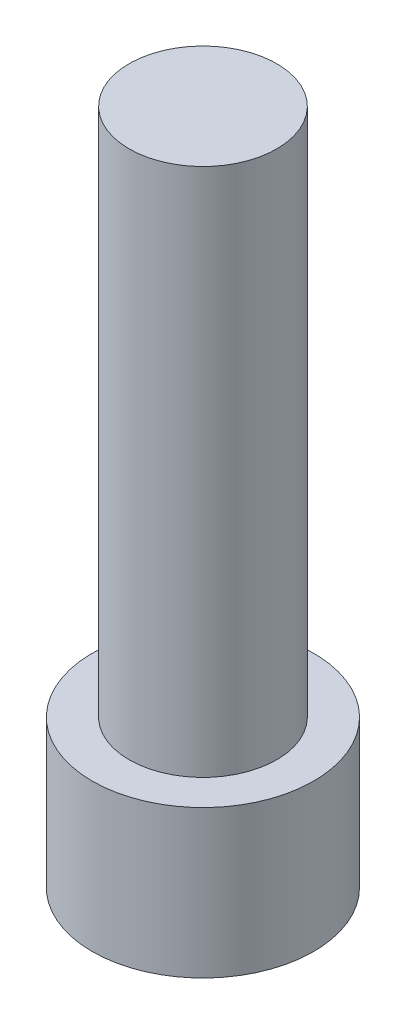
ISO-10303-21;
HEADER;
FILE_DESCRIPTION(('STEP AP214'),'2;1');
FILE_NAME('part.step','',(''),(''),'','','');
FILE_SCHEMA(('AUTOMOTIVE_DESIGN { 1 0 10303 214 1 1 1 1 }'));
ENDSEC;
DATA;
#1=APPLICATION_CONTEXT('core data for automotive mechanical design processes');
#2=APPLICATION_PROTOCOL_DEFINITION('international standard','automotive_design',2000,#1);
#3=PRODUCT_CONTEXT('',#1,'mechanical');
#4=PRODUCT('Part','Part','',(#3));
#5=PRODUCT_RELATED_PRODUCT_CATEGORY('part','',(#4));
#6=PRODUCT_DEFINITION_FORMATION('','',#4);
#7=PRODUCT_DEFINITION_CONTEXT('part definition',#1,'design');
#8=PRODUCT_DEFINITION('design','',#6,#7);
#9=PRODUCT_DEFINITION_SHAPE('','',#8);
#10=(LENGTH_UNIT() NAMED_UNIT(*) SI_UNIT(.MILLI.,.METRE.));
#11=(NAMED_UNIT(*) PLANE_ANGLE_UNIT() SI_UNIT($,.RADIAN.));
#12=(NAMED_UNIT(*) SI_UNIT($,.STERADIAN.) SOLID_ANGLE_UNIT());
#13=UNCERTAINTY_MEASURE_WITH_UNIT(LENGTH_MEASURE(1.E-05),#10,'distance_accuracy_value','');
#14=(GEOMETRIC_REPRESENTATION_CONTEXT(3) GLOBAL_UNCERTAINTY_ASSIGNED_CONTEXT((#13)) GLOBAL_UNIT_ASSIGNED_CONTEXT((#10,
#11,#12)) REPRESENTATION_CONTEXT('',''));
#15=CARTESIAN_POINT('',(0.,0.,0.));
#16=DIRECTION('',(0.,0.,1.));
#17=DIRECTION('',(1.,0.,0.));
#18=AXIS2_PLACEMENT_3D('',#15,#16,#17);
#19=CARTESIAN_POINT('',(0.,6.,0.));
#20=DIRECTION('',(0.,-1.,0.));
#21=DIRECTION('',(0.,0.,-1.));
#22=AXIS2_PLACEMENT_3D('',#19,#20,#21);
#23=CYLINDRICAL_SURFACE('',#22,4.5);
#24=CARTESIAN_POINT('',(0.,6.,0.));
#25=DIRECTION('',(0.,1.,0.));
#26=DIRECTION('',(0.,0.,1.));
#27=AXIS2_PLACEMENT_3D('',#24,#25,#26);
#28=CIRCLE('',#27,4.5);
#29=CARTESIAN_POINT('',(0.,6.,4.5));
#30=VERTEX_POINT('',#29);
#31=EDGE_CURVE('E45',#30,#30,#28,.T.);
#32=ORIENTED_EDGE('',*,*,#31,.F.);
#33=EDGE_LOOP('',(#32));
#34=FACE_BOUND('',#33,.T.);
#35=CARTESIAN_POINT('',(0.,0.,0.));
#36=DIRECTION('',(0.,1.,0.));
#37=DIRECTION('',(0.,0.,1.));
#38=AXIS2_PLACEMENT_3D('',#35,#36,#37);
#39=CIRCLE('',#38,4.5);
#40=CARTESIAN_POINT('',(0.,0.,4.5));
#41=VERTEX_POINT('',#40);
#42=EDGE_CURVE('E40',#41,#41,#39,.T.);
#43=ORIENTED_EDGE('',*,*,#42,.T.);
#44=EDGE_LOOP('',(#43));
#45=FACE_BOUND('',#44,.T.);
#46=ADVANCED_FACE('F37',(#34,#45),#23,.T.);
#47=CARTESIAN_POINT('',(0.,6.,0.));
#48=DIRECTION('',(0.,1.,0.));
#49=DIRECTION('',(0.,0.,1.));
#50=AXIS2_PLACEMENT_3D('',#47,#48,#49);
#51=PLANE('',#50);
#52=CARTESIAN_POINT('',(0.,6.,0.));
#53=DIRECTION('',(0.,1.,0.));
#54=DIRECTION('',(0.,0.,1.));
#55=AXIS2_PLACEMENT_3D('',#52,#53,#54);
#56=CIRCLE('',#55,3.);
#57=CARTESIAN_POINT('',(0.,6.,3.));
#58=VERTEX_POINT('',#57);
#59=EDGE_CURVE('E11',#58,#58,#56,.T.);
#60=ORIENTED_EDGE('',*,*,#59,.F.);
#61=EDGE_LOOP('',(#60));
#62=FACE_BOUND('',#61,.T.);
#63=ORIENTED_EDGE('',*,*,#31,.T.);
#64=EDGE_LOOP('',(#63));
#65=FACE_BOUND('',#64,.T.);
#66=ADVANCED_FACE('F157',(#62,#65),#51,.T.);
#67=CARTESIAN_POINT('',(0.,0.,0.));
#68=DIRECTION('',(0.,1.,0.));
#69=DIRECTION('',(0.,0.,1.));
#70=AXIS2_PLACEMENT_3D('',#67,#68,#69);
#71=PLANE('',#70);
#72=DIRECTION('',(-0.5,0.,0.866025403784438));
#73=VECTOR('',#72,1.);
#74=CARTESIAN_POINT('',(2.88675134594813,0.,0.));
#75=LINE('',#74,#73);
#76=CARTESIAN_POINT('',(2.88675134594813,0.,0.));
#77=VERTEX_POINT('',#76);
#78=CARTESIAN_POINT('',(1.44337567297406,0.,2.5));
#79=VERTEX_POINT('',#78);
#80=EDGE_CURVE('E127',#77,#79,#75,.T.);
#81=ORIENTED_EDGE('',*,*,#80,.F.);
#82=DIRECTION('',(0.5,0.,0.866025403784439));
#83=VECTOR('',#82,1.);
#84=CARTESIAN_POINT('',(1.44337567297407,0.,-2.5));
#85=LINE('',#84,#83);
#86=CARTESIAN_POINT('',(1.44337567297407,0.,-2.5));
#87=VERTEX_POINT('',#86);
#88=EDGE_CURVE('E53',#87,#77,#85,.T.);
#89=ORIENTED_EDGE('',*,*,#88,.F.);
#90=DIRECTION('',(1.,0.,0.));
#91=VECTOR('',#90,1.);
#92=CARTESIAN_POINT('',(-1.44337567297406,0.,-2.5));
#93=LINE('',#92,#91);
#94=CARTESIAN_POINT('',(-1.44337567297406,0.,-2.5));
#95=VERTEX_POINT('',#94);
#96=EDGE_CURVE('E136',#95,#87,#93,.T.);
#97=ORIENTED_EDGE('',*,*,#96,.F.);
#98=DIRECTION('',(0.5,0.,-0.866025403784438));
#99=VECTOR('',#98,1.);
#100=CARTESIAN_POINT('',(-2.88675134594813,0.,0.));
#101=LINE('',#100,#99);
#102=CARTESIAN_POINT('',(-2.88675134594813,0.,0.));
#103=VERTEX_POINT('',#102);
#104=EDGE_CURVE('E134',#103,#95,#101,.T.);
#105=ORIENTED_EDGE('',*,*,#104,.F.);
#106=DIRECTION('',(-0.5,0.,-0.866025403784439));
#107=VECTOR('',#106,1.);
#108=CARTESIAN_POINT('',(-1.44337567297406,0.,2.5));
#109=LINE('',#108,#107);
#110=CARTESIAN_POINT('',(-1.44337567297406,0.,2.5));
#111=VERTEX_POINT('',#110);
#112=EDGE_CURVE('E101',#111,#103,#109,.T.);
#113=ORIENTED_EDGE('',*,*,#112,.F.);
#114=DIRECTION('',(-1.,0.,0.));
#115=VECTOR('',#114,1.);
#116=CARTESIAN_POINT('',(1.44337567297406,0.,2.5));
#117=LINE('',#116,#115);
#118=EDGE_CURVE('E130',#79,#111,#117,.T.);
#119=ORIENTED_EDGE('',*,*,#118,.F.);
#120=EDGE_LOOP('',(#81,#89,#97,#105,#113,#119));
#121=FACE_BOUND('',#120,.T.);
#122=ORIENTED_EDGE('',*,*,#42,.F.);
#123=EDGE_LOOP('',(#122));
#124=FACE_BOUND('',#123,.T.);
#125=ADVANCED_FACE('F154',(#121,#124),#71,.F.);
#126=CARTESIAN_POINT('',(0.,27.5,0.));
#127=DIRECTION('',(0.,-1.,0.));
#128=DIRECTION('',(0.,0.,-1.));
#129=AXIS2_PLACEMENT_3D('',#126,#127,#128);
#130=CYLINDRICAL_SURFACE('',#129,3.);
#131=CARTESIAN_POINT('',(0.,27.5,0.));
#132=DIRECTION('',(0.,1.,0.));
#133=DIRECTION('',(0.,0.,1.));
#134=AXIS2_PLACEMENT_3D('',#131,#132,#133);
#135=CIRCLE('',#134,3.);
#136=CARTESIAN_POINT('',(0.,27.5,3.));
#137=VERTEX_POINT('',#136);
#138=EDGE_CURVE('E140',#137,#137,#135,.T.);
#139=ORIENTED_EDGE('',*,*,#138,.F.);
#140=EDGE_LOOP('',(#139));
#141=FACE_BOUND('',#140,.T.);
#142=ORIENTED_EDGE('',*,*,#59,.T.);
#143=EDGE_LOOP('',(#142));
#144=FACE_BOUND('',#143,.T.);
#145=ADVANCED_FACE('F156',(#141,#144),#130,.T.);
#146=CARTESIAN_POINT('',(0.,27.5,0.));
#147=DIRECTION('',(0.,1.,0.));
#148=DIRECTION('',(0.,0.,1.));
#149=AXIS2_PLACEMENT_3D('',#146,#147,#148);
#150=PLANE('',#149);
#151=ORIENTED_EDGE('',*,*,#138,.T.);
#152=EDGE_LOOP('',(#151));
#153=FACE_BOUND('',#152,.T.);
#154=ADVANCED_FACE('F163',(#153),#150,.T.);
#155=CARTESIAN_POINT('',(1.44337567297407,5.,-2.5));
#156=DIRECTION('',(0.866025403784439,0.,-0.5));
#157=DIRECTION('',(-0.5,0.,-0.866025403784439));
#158=AXIS2_PLACEMENT_3D('',#155,#156,#157);
#159=PLANE('',#158);
#160=ORIENTED_EDGE('',*,*,#88,.T.);
#161=DIRECTION('',(0.,-1.,0.));
#162=VECTOR('',#161,1.);
#163=CARTESIAN_POINT('',(2.88675134594813,5.,0.));
#164=LINE('',#163,#162);
#165=CARTESIAN_POINT('',(2.88675134594813,5.,0.));
#166=VERTEX_POINT('',#165);
#167=EDGE_CURVE('E83',#166,#77,#164,.T.);
#168=ORIENTED_EDGE('',*,*,#167,.F.);
#169=DIRECTION('',(0.5,0.,0.866025403784439));
#170=VECTOR('',#169,1.);
#171=CARTESIAN_POINT('',(1.44337567297407,5.,-2.5));
#172=LINE('',#171,#170);
#173=CARTESIAN_POINT('',(1.44337567297407,5.,-2.5));
#174=VERTEX_POINT('',#173);
#175=EDGE_CURVE('E138',#174,#166,#172,.T.);
#176=ORIENTED_EDGE('',*,*,#175,.F.);
#177=DIRECTION('',(0.,-1.,0.));
#178=VECTOR('',#177,1.);
#179=CARTESIAN_POINT('',(1.44337567297407,5.,-2.5));
#180=LINE('',#179,#178);
#181=EDGE_CURVE('E61',#174,#87,#180,.T.);
#182=ORIENTED_EDGE('',*,*,#181,.T.);
#183=EDGE_LOOP('',(#160,#168,#176,#182));
#184=FACE_BOUND('',#183,.T.);
#185=ADVANCED_FACE('F192',(#184),#159,.F.);
#186=CARTESIAN_POINT('',(-1.44337567297406,5.,-2.5));
#187=DIRECTION('',(0.,0.,-1.));
#188=DIRECTION('',(-1.,0.,0.));
#189=AXIS2_PLACEMENT_3D('',#186,#187,#188);
#190=PLANE('',#189);
#191=ORIENTED_EDGE('',*,*,#96,.T.);
#192=ORIENTED_EDGE('',*,*,#181,.F.);
#193=DIRECTION('',(1.,0.,0.));
#194=VECTOR('',#193,1.);
#195=CARTESIAN_POINT('',(-1.44337567297406,5.,-2.5));
#196=LINE('',#195,#194);
#197=CARTESIAN_POINT('',(-1.44337567297406,5.,-2.5));
#198=VERTEX_POINT('',#197);
#199=EDGE_CURVE('E113',#198,#174,#196,.T.);
#200=ORIENTED_EDGE('',*,*,#199,.F.);
#201=DIRECTION('',(0.,-1.,0.));
#202=VECTOR('',#201,1.);
#203=CARTESIAN_POINT('',(-1.44337567297406,5.,-2.5));
#204=LINE('',#203,#202);
#205=EDGE_CURVE('E105',#198,#95,#204,.T.);
#206=ORIENTED_EDGE('',*,*,#205,.T.);
#207=EDGE_LOOP('',(#191,#192,#200,#206));
#208=FACE_BOUND('',#207,.T.);
#209=ADVANCED_FACE('F206',(#208),#190,.F.);
#210=CARTESIAN_POINT('',(-2.88675134594813,5.,0.));
#211=DIRECTION('',(-0.866025403784438,0.,-0.5));
#212=DIRECTION('',(-0.5,0.,0.866025403784438));
#213=AXIS2_PLACEMENT_3D('',#210,#211,#212);
#214=PLANE('',#213);
#215=ORIENTED_EDGE('',*,*,#104,.T.);
#216=ORIENTED_EDGE('',*,*,#205,.F.);
#217=DIRECTION('',(0.5,0.,-0.866025403784438));
#218=VECTOR('',#217,1.);
#219=CARTESIAN_POINT('',(-2.88675134594813,5.,0.));
#220=LINE('',#219,#218);
#221=CARTESIAN_POINT('',(-2.88675134594813,5.,0.));
#222=VERTEX_POINT('',#221);
#223=EDGE_CURVE('E109',#222,#198,#220,.T.);
#224=ORIENTED_EDGE('',*,*,#223,.F.);
#225=DIRECTION('',(0.,-1.,0.));
#226=VECTOR('',#225,1.);
#227=CARTESIAN_POINT('',(-2.88675134594813,5.,0.));
#228=LINE('',#227,#226);
#229=EDGE_CURVE('E94',#222,#103,#228,.T.);
#230=ORIENTED_EDGE('',*,*,#229,.T.);
#231=EDGE_LOOP('',(#215,#216,#224,#230));
#232=FACE_BOUND('',#231,.T.);
#233=ADVANCED_FACE('F110',(#232),#214,.F.);
#234=CARTESIAN_POINT('',(-1.44337567297406,5.,2.5));
#235=DIRECTION('',(-0.866025403784439,0.,0.5));
#236=DIRECTION('',(0.5,0.,0.866025403784439));
#237=AXIS2_PLACEMENT_3D('',#234,#235,#236);
#238=PLANE('',#237);
#239=ORIENTED_EDGE('',*,*,#112,.T.);
#240=ORIENTED_EDGE('',*,*,#229,.F.);
#241=DIRECTION('',(-0.5,0.,-0.866025403784439));
#242=VECTOR('',#241,1.);
#243=CARTESIAN_POINT('',(-1.44337567297406,5.,2.5));
#244=LINE('',#243,#242);
#245=CARTESIAN_POINT('',(-1.44337567297406,5.,2.5));
#246=VERTEX_POINT('',#245);
#247=EDGE_CURVE('E98',#246,#222,#244,.T.);
#248=ORIENTED_EDGE('',*,*,#247,.F.);
#249=DIRECTION('',(0.,-1.,0.));
#250=VECTOR('',#249,1.);
#251=CARTESIAN_POINT('',(-1.44337567297406,5.,2.5));
#252=LINE('',#251,#250);
#253=EDGE_CURVE('E106',#246,#111,#252,.T.);
#254=ORIENTED_EDGE('',*,*,#253,.T.);
#255=EDGE_LOOP('',(#239,#240,#248,#254));
#256=FACE_BOUND('',#255,.T.);
#257=ADVANCED_FACE('F96',(#256),#238,.F.);
#258=CARTESIAN_POINT('',(1.44337567297406,5.,2.5));
#259=DIRECTION('',(0.,0.,1.));
#260=DIRECTION('',(1.,0.,0.));
#261=AXIS2_PLACEMENT_3D('',#258,#259,#260);
#262=PLANE('',#261);
#263=ORIENTED_EDGE('',*,*,#118,.T.);
#264=ORIENTED_EDGE('',*,*,#253,.F.);
#265=DIRECTION('',(-1.,0.,0.));
#266=VECTOR('',#265,1.);
#267=CARTESIAN_POINT('',(1.44337567297406,5.,2.5));
#268=LINE('',#267,#266);
#269=CARTESIAN_POINT('',(1.44337567297406,5.,2.5));
#270=VERTEX_POINT('',#269);
#271=EDGE_CURVE('E119',#270,#246,#268,.T.);
#272=ORIENTED_EDGE('',*,*,#271,.F.);
#273=DIRECTION('',(0.,-1.,0.));
#274=VECTOR('',#273,1.);
#275=CARTESIAN_POINT('',(1.44337567297406,5.,2.5));
#276=LINE('',#275,#274);
#277=EDGE_CURVE('E143',#270,#79,#276,.T.);
#278=ORIENTED_EDGE('',*,*,#277,.T.);
#279=EDGE_LOOP('',(#263,#264,#272,#278));
#280=FACE_BOUND('',#279,.T.);
#281=ADVANCED_FACE('F231',(#280),#262,.F.);
#282=CARTESIAN_POINT('',(2.88675134594813,5.,0.));
#283=DIRECTION('',(0.866025403784438,0.,0.5));
#284=DIRECTION('',(0.5,0.,-0.866025403784438));
#285=AXIS2_PLACEMENT_3D('',#282,#283,#284);
#286=PLANE('',#285);
#287=ORIENTED_EDGE('',*,*,#80,.T.);
#288=ORIENTED_EDGE('',*,*,#277,.F.);
#289=DIRECTION('',(-0.5,0.,0.866025403784438));
#290=VECTOR('',#289,1.);
#291=CARTESIAN_POINT('',(2.88675134594813,5.,0.));
#292=LINE('',#291,#290);
#293=EDGE_CURVE('E121',#166,#270,#292,.T.);
#294=ORIENTED_EDGE('',*,*,#293,.F.);
#295=ORIENTED_EDGE('',*,*,#167,.T.);
#296=EDGE_LOOP('',(#287,#288,#294,#295));
#297=FACE_BOUND('',#296,.T.);
#298=ADVANCED_FACE('F240',(#297),#286,.F.);
#299=CARTESIAN_POINT('',(0.,5.,0.));
#300=DIRECTION('',(0.,-1.,0.));
#301=DIRECTION('',(0.,0.,-1.));
#302=AXIS2_PLACEMENT_3D('',#299,#300,#301);
#303=PLANE('',#302);
#304=ORIENTED_EDGE('',*,*,#175,.T.);
#305=ORIENTED_EDGE('',*,*,#293,.T.);
#306=ORIENTED_EDGE('',*,*,#271,.T.);
#307=ORIENTED_EDGE('',*,*,#247,.T.);
#308=ORIENTED_EDGE('',*,*,#223,.T.);
#309=ORIENTED_EDGE('',*,*,#199,.T.);
#310=EDGE_LOOP('',(#304,#305,#306,#307,#308,#309));
#311=FACE_BOUND('',#310,.T.);
#312=ADVANCED_FACE('F116',(#311),#303,.T.);
#313=CLOSED_SHELL('',(#46,#66,#125,#145,#154,#185,#209,#233,#257,#281,#298,#312));
#314=MANIFOLD_SOLID_BREP('B2',#313);
#315=ADVANCED_BREP_SHAPE_REPRESENTATION('',(#18,#314),#14);
#316=SHAPE_DEFINITION_REPRESENTATION(#9,#315);
ENDSEC;
END-ISO-10303-21;
